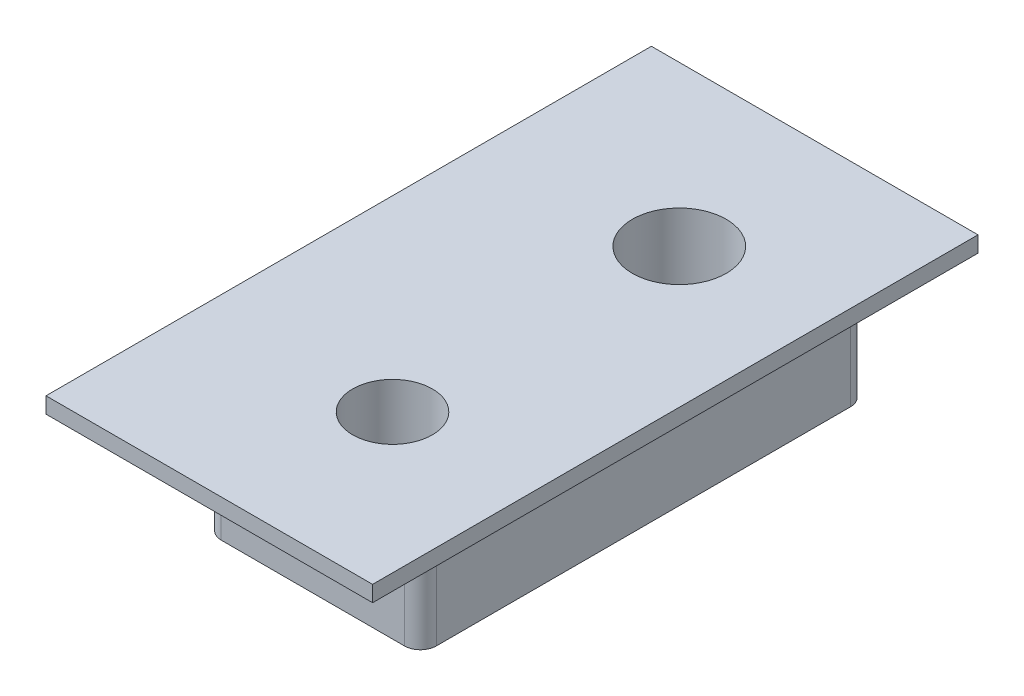
ISO-10303-21;
HEADER;
FILE_DESCRIPTION(('STEP AP214'),'2;1');
FILE_NAME('part.step','',(''),(''),'','','');
FILE_SCHEMA(('AUTOMOTIVE_DESIGN { 1 0 10303 214 1 1 1 1 }'));
ENDSEC;
DATA;
#1=APPLICATION_CONTEXT('core data for automotive mechanical design processes');
#2=APPLICATION_PROTOCOL_DEFINITION('international standard','automotive_design',2000,#1);
#3=PRODUCT_CONTEXT('',#1,'mechanical');
#4=PRODUCT('Part','Part','',(#3));
#5=PRODUCT_RELATED_PRODUCT_CATEGORY('part','',(#4));
#6=PRODUCT_DEFINITION_FORMATION('','',#4);
#7=PRODUCT_DEFINITION_CONTEXT('part definition',#1,'design');
#8=PRODUCT_DEFINITION('design','',#6,#7);
#9=PRODUCT_DEFINITION_SHAPE('','',#8);
#10=(LENGTH_UNIT() NAMED_UNIT(*) SI_UNIT(.MILLI.,.METRE.));
#11=(NAMED_UNIT(*) PLANE_ANGLE_UNIT() SI_UNIT($,.RADIAN.));
#12=(NAMED_UNIT(*) SI_UNIT($,.STERADIAN.) SOLID_ANGLE_UNIT());
#13=UNCERTAINTY_MEASURE_WITH_UNIT(LENGTH_MEASURE(1.E-05),#10,'distance_accuracy_value','');
#14=(GEOMETRIC_REPRESENTATION_CONTEXT(3) GLOBAL_UNCERTAINTY_ASSIGNED_CONTEXT((#13)) GLOBAL_UNIT_ASSIGNED_CONTEXT((#10,
#11,#12)) REPRESENTATION_CONTEXT('',''));
#15=CARTESIAN_POINT('',(0.,0.,0.));
#16=DIRECTION('',(0.,0.,1.));
#17=DIRECTION('',(1.,0.,0.));
#18=AXIS2_PLACEMENT_3D('',#15,#16,#17);
#19=CARTESIAN_POINT('',(5.875,117.675,-9.5));
#20=DIRECTION('',(0.,0.,1.));
#21=DIRECTION('',(1.,0.,0.));
#22=AXIS2_PLACEMENT_3D('',#19,#20,#21);
#23=PLANE('',#22);
#24=DIRECTION('',(0.,1.,0.));
#25=VECTOR('',#24,1.);
#26=CARTESIAN_POINT('',(4.375,117.175,-9.5));
#27=LINE('',#26,#25);
#28=CARTESIAN_POINT('',(4.375,117.175,-9.5));
#29=VERTEX_POINT('',#28);
#30=CARTESIAN_POINT('',(4.375,117.675,-9.5));
#31=VERTEX_POINT('',#30);
#32=EDGE_CURVE('E118',#29,#31,#27,.T.);
#33=ORIENTED_EDGE('',*,*,#32,.F.);
#34=DIRECTION('',(-1.,0.,0.));
#35=VECTOR('',#34,1.);
#36=CARTESIAN_POINT('',(5.875,117.175,-9.5));
#37=LINE('',#36,#35);
#38=CARTESIAN_POINT('',(-5.875,117.175,-9.5));
#39=VERTEX_POINT('',#38);
#40=EDGE_CURVE('E128',#29,#39,#37,.T.);
#41=ORIENTED_EDGE('',*,*,#40,.T.);
#42=DIRECTION('',(0.,-1.,0.));
#43=VECTOR('',#42,1.);
#44=CARTESIAN_POINT('',(-5.875,117.675,-9.5));
#45=LINE('',#44,#43);
#46=CARTESIAN_POINT('',(-5.875,117.675,-9.5));
#47=VERTEX_POINT('',#46);
#48=EDGE_CURVE('E151',#47,#39,#45,.T.);
#49=ORIENTED_EDGE('',*,*,#48,.F.);
#50=DIRECTION('',(-1.,0.,0.));
#51=VECTOR('',#50,1.);
#52=CARTESIAN_POINT('',(5.875,117.675,-9.5));
#53=LINE('',#52,#51);
#54=EDGE_CURVE('E130',#31,#47,#53,.T.);
#55=ORIENTED_EDGE('',*,*,#54,.F.);
#56=EDGE_LOOP('',(#33,#41,#49,#55));
#57=FACE_BOUND('',#56,.T.);
#58=ADVANCED_FACE('F30',(#57),#23,.F.);
#59=CARTESIAN_POINT('',(-5.875,117.675,9.5));
#60=DIRECTION('',(0.,0.,-1.));
#61=DIRECTION('',(-1.,0.,0.));
#62=AXIS2_PLACEMENT_3D('',#59,#60,#61);
#63=PLANE('',#62);
#64=DIRECTION('',(0.,-1.,0.));
#65=VECTOR('',#64,1.);
#66=CARTESIAN_POINT('',(4.375,117.675,9.5));
#67=LINE('',#66,#65);
#68=CARTESIAN_POINT('',(4.375,117.675,9.5));
#69=VERTEX_POINT('',#68);
#70=CARTESIAN_POINT('',(4.375,117.175,9.5));
#71=VERTEX_POINT('',#70);
#72=EDGE_CURVE('E45',#69,#71,#67,.T.);
#73=ORIENTED_EDGE('',*,*,#72,.F.);
#74=DIRECTION('',(1.,0.,0.));
#75=VECTOR('',#74,1.);
#76=CARTESIAN_POINT('',(-5.875,117.675,9.5));
#77=LINE('',#76,#75);
#78=CARTESIAN_POINT('',(-5.875,117.675,9.5));
#79=VERTEX_POINT('',#78);
#80=EDGE_CURVE('E144',#79,#69,#77,.T.);
#81=ORIENTED_EDGE('',*,*,#80,.F.);
#82=DIRECTION('',(0.,-1.,0.));
#83=VECTOR('',#82,1.);
#84=CARTESIAN_POINT('',(-5.875,117.675,9.5));
#85=LINE('',#84,#83);
#86=CARTESIAN_POINT('',(-5.875,117.175,9.5));
#87=VERTEX_POINT('',#86);
#88=EDGE_CURVE('E148',#79,#87,#85,.T.);
#89=ORIENTED_EDGE('',*,*,#88,.T.);
#90=DIRECTION('',(1.,0.,0.));
#91=VECTOR('',#90,1.);
#92=CARTESIAN_POINT('',(-5.875,117.175,9.5));
#93=LINE('',#92,#91);
#94=EDGE_CURVE('E138',#87,#71,#93,.T.);
#95=ORIENTED_EDGE('',*,*,#94,.T.);
#96=EDGE_LOOP('',(#73,#81,#89,#95));
#97=FACE_BOUND('',#96,.T.);
#98=ADVANCED_FACE('F255',(#97),#63,.F.);
#99=CARTESIAN_POINT('',(5.875,117.675,-9.5));
#100=DIRECTION('',(0.,1.,0.));
#101=DIRECTION('',(0.,0.,1.));
#102=AXIS2_PLACEMENT_3D('',#99,#100,#101);
#103=PLANE('',#102);
#104=CARTESIAN_POINT('',(0.,117.675,-4.5));
#105=DIRECTION('',(0.,1.,0.));
#106=DIRECTION('',(0.,0.,1.));
#107=AXIS2_PLACEMENT_3D('',#104,#105,#106);
#108=CIRCLE('',#107,1.47319999999999);
#109=CARTESIAN_POINT('',(0.,117.675,-3.02680000000001));
#110=VERTEX_POINT('',#109);
#111=EDGE_CURVE('E141',#110,#110,#108,.T.);
#112=ORIENTED_EDGE('',*,*,#111,.F.);
#113=EDGE_LOOP('',(#112));
#114=FACE_BOUND('',#113,.T.);
#115=CARTESIAN_POINT('',(0.,117.675,4.5));
#116=DIRECTION('',(0.,1.,0.));
#117=DIRECTION('',(0.,0.,1.));
#118=AXIS2_PLACEMENT_3D('',#115,#116,#117);
#119=CIRCLE('',#118,1.25);
#120=CARTESIAN_POINT('',(0.,117.675,5.75));
#121=VERTEX_POINT('',#120);
#122=EDGE_CURVE('E292',#121,#121,#119,.T.);
#123=ORIENTED_EDGE('',*,*,#122,.F.);
#124=EDGE_LOOP('',(#123));
#125=FACE_BOUND('',#124,.T.);
#126=ORIENTED_EDGE('',*,*,#80,.T.);
#127=DIRECTION('',(0.,0.,1.));
#128=VECTOR('',#127,1.);
#129=CARTESIAN_POINT('',(4.375,117.675,-9.5));
#130=LINE('',#129,#128);
#131=EDGE_CURVE('E131',#31,#69,#130,.T.);
#132=ORIENTED_EDGE('',*,*,#131,.F.);
#133=ORIENTED_EDGE('',*,*,#54,.T.);
#134=DIRECTION('',(0.,0.,1.));
#135=VECTOR('',#134,1.);
#136=CARTESIAN_POINT('',(-5.875,117.675,-9.5));
#137=LINE('',#136,#135);
#138=EDGE_CURVE('E296',#47,#79,#137,.T.);
#139=ORIENTED_EDGE('',*,*,#138,.T.);
#140=EDGE_LOOP('',(#126,#132,#133,#139));
#141=FACE_BOUND('',#140,.T.);
#142=ADVANCED_FACE('F260',(#114,#125,#141),#103,.T.);
#143=CARTESIAN_POINT('',(5.875,117.175,-9.5));
#144=DIRECTION('',(0.,1.,0.));
#145=DIRECTION('',(0.,0.,1.));
#146=AXIS2_PLACEMENT_3D('',#143,#144,#145);
#147=PLANE('',#146);
#148=DIRECTION('',(-1.,0.,0.));
#149=VECTOR('',#148,1.);
#150=CARTESIAN_POINT('',(-3.375,117.175,7.));
#151=LINE('',#150,#149);
#152=CARTESIAN_POINT('',(2.875,117.175,7.));
#153=VERTEX_POINT('',#152);
#154=CARTESIAN_POINT('',(-2.875,117.175,7.));
#155=VERTEX_POINT('',#154);
#156=EDGE_CURVE('E157',#153,#155,#151,.T.);
#157=ORIENTED_EDGE('',*,*,#156,.F.);
#158=CARTESIAN_POINT('',(2.875,117.175,6.5));
#159=DIRECTION('',(0.,1.,0.));
#160=DIRECTION('',(0.,0.,1.));
#161=AXIS2_PLACEMENT_3D('',#158,#159,#160);
#162=CIRCLE('',#161,0.5);
#163=CARTESIAN_POINT('',(3.375,117.175,6.5));
#164=VERTEX_POINT('',#163);
#165=EDGE_CURVE('E11',#153,#164,#162,.T.);
#166=ORIENTED_EDGE('',*,*,#165,.T.);
#167=DIRECTION('',(0.,0.,-1.));
#168=VECTOR('',#167,1.);
#169=CARTESIAN_POINT('',(3.375,117.175,7.));
#170=LINE('',#169,#168);
#171=CARTESIAN_POINT('',(3.375,117.175,-6.5));
#172=VERTEX_POINT('',#171);
#173=EDGE_CURVE('E171',#164,#172,#170,.T.);
#174=ORIENTED_EDGE('',*,*,#173,.T.);
#175=CARTESIAN_POINT('',(2.875,117.175,-6.5));
#176=DIRECTION('',(0.,1.,0.));
#177=DIRECTION('',(0.,0.,1.));
#178=AXIS2_PLACEMENT_3D('',#175,#176,#177);
#179=CIRCLE('',#178,0.5);
#180=CARTESIAN_POINT('',(2.875,117.175,-7.));
#181=VERTEX_POINT('',#180);
#182=EDGE_CURVE('E38',#172,#181,#179,.T.);
#183=ORIENTED_EDGE('',*,*,#182,.T.);
#184=DIRECTION('',(-1.,0.,0.));
#185=VECTOR('',#184,1.);
#186=CARTESIAN_POINT('',(-3.375,117.175,-7.));
#187=LINE('',#186,#185);
#188=CARTESIAN_POINT('',(-2.875,117.175,-7.));
#189=VERTEX_POINT('',#188);
#190=EDGE_CURVE('E158',#181,#189,#187,.T.);
#191=ORIENTED_EDGE('',*,*,#190,.T.);
#192=CARTESIAN_POINT('',(-2.875,117.175,-6.5));
#193=DIRECTION('',(0.,1.,0.));
#194=DIRECTION('',(0.,0.,1.));
#195=AXIS2_PLACEMENT_3D('',#192,#193,#194);
#196=CIRCLE('',#195,0.5);
#197=CARTESIAN_POINT('',(-3.375,117.175,-6.5));
#198=VERTEX_POINT('',#197);
#199=EDGE_CURVE('E204',#189,#198,#196,.T.);
#200=ORIENTED_EDGE('',*,*,#199,.T.);
#201=DIRECTION('',(0.,0.,-1.));
#202=VECTOR('',#201,1.);
#203=CARTESIAN_POINT('',(-3.375,117.175,7.));
#204=LINE('',#203,#202);
#205=CARTESIAN_POINT('',(-3.375,117.175,6.5));
#206=VERTEX_POINT('',#205);
#207=EDGE_CURVE('E168',#206,#198,#204,.T.);
#208=ORIENTED_EDGE('',*,*,#207,.F.);
#209=CARTESIAN_POINT('',(-2.875,117.175,6.5));
#210=DIRECTION('',(0.,1.,0.));
#211=DIRECTION('',(0.,0.,1.));
#212=AXIS2_PLACEMENT_3D('',#209,#210,#211);
#213=CIRCLE('',#212,0.5);
#214=EDGE_CURVE('E206',#206,#155,#213,.T.);
#215=ORIENTED_EDGE('',*,*,#214,.T.);
#216=EDGE_LOOP('',(#157,#166,#174,#183,#191,#200,#208,#215));
#217=FACE_BOUND('',#216,.T.);
#218=DIRECTION('',(0.,0.,-1.));
#219=VECTOR('',#218,1.);
#220=CARTESIAN_POINT('',(4.375,117.175,9.5));
#221=LINE('',#220,#219);
#222=EDGE_CURVE('E115',#71,#29,#221,.T.);
#223=ORIENTED_EDGE('',*,*,#222,.F.);
#224=ORIENTED_EDGE('',*,*,#94,.F.);
#225=DIRECTION('',(0.,0.,1.));
#226=VECTOR('',#225,1.);
#227=CARTESIAN_POINT('',(-5.875,117.175,-9.5));
#228=LINE('',#227,#226);
#229=EDGE_CURVE('E135',#39,#87,#228,.T.);
#230=ORIENTED_EDGE('',*,*,#229,.F.);
#231=ORIENTED_EDGE('',*,*,#40,.F.);
#232=EDGE_LOOP('',(#223,#224,#230,#231));
#233=FACE_BOUND('',#232,.T.);
#234=ADVANCED_FACE('F134',(#217,#233),#147,.F.);
#235=CARTESIAN_POINT('',(3.375,114.,7.));
#236=DIRECTION('',(0.,1.,0.));
#237=DIRECTION('',(0.,0.,1.));
#238=AXIS2_PLACEMENT_3D('',#235,#236,#237);
#239=PLANE('',#238);
#240=CARTESIAN_POINT('',(0.,114.,4.5));
#241=DIRECTION('',(0.,1.,0.));
#242=DIRECTION('',(0.,0.,1.));
#243=AXIS2_PLACEMENT_3D('',#240,#241,#242);
#244=CIRCLE('',#243,1.25);
#245=CARTESIAN_POINT('',(0.,114.,5.75));
#246=VERTEX_POINT('',#245);
#247=EDGE_CURVE('E282',#246,#246,#244,.T.);
#248=ORIENTED_EDGE('',*,*,#247,.T.);
#249=EDGE_LOOP('',(#248));
#250=FACE_BOUND('',#249,.T.);
#251=CARTESIAN_POINT('',(0.,114.,-4.5));
#252=DIRECTION('',(0.,1.,0.));
#253=DIRECTION('',(0.,0.,1.));
#254=AXIS2_PLACEMENT_3D('',#251,#252,#253);
#255=CIRCLE('',#254,1.4732);
#256=CARTESIAN_POINT('',(0.,114.,-3.0268));
#257=VERTEX_POINT('',#256);
#258=EDGE_CURVE('E136',#257,#257,#255,.T.);
#259=ORIENTED_EDGE('',*,*,#258,.T.);
#260=EDGE_LOOP('',(#259));
#261=FACE_BOUND('',#260,.T.);
#262=DIRECTION('',(0.,0.,-1.));
#263=VECTOR('',#262,1.);
#264=CARTESIAN_POINT('',(-3.375,114.,7.));
#265=LINE('',#264,#263);
#266=CARTESIAN_POINT('',(-3.375,114.,6.5));
#267=VERTEX_POINT('',#266);
#268=CARTESIAN_POINT('',(-3.375,114.,-6.5));
#269=VERTEX_POINT('',#268);
#270=EDGE_CURVE('E161',#267,#269,#265,.T.);
#271=ORIENTED_EDGE('',*,*,#270,.T.);
#272=CARTESIAN_POINT('',(-2.875,114.,-6.5));
#273=DIRECTION('',(0.,1.,0.));
#274=DIRECTION('',(0.,0.,1.));
#275=AXIS2_PLACEMENT_3D('',#272,#273,#274);
#276=CIRCLE('',#275,0.5);
#277=CARTESIAN_POINT('',(-2.875,114.,-7.));
#278=VERTEX_POINT('',#277);
#279=EDGE_CURVE('E188',#269,#278,#276,.F.);
#280=ORIENTED_EDGE('',*,*,#279,.T.);
#281=DIRECTION('',(1.,0.,0.));
#282=VECTOR('',#281,1.);
#283=CARTESIAN_POINT('',(3.375,114.,-7.));
#284=LINE('',#283,#282);
#285=CARTESIAN_POINT('',(2.875,114.,-7.));
#286=VERTEX_POINT('',#285);
#287=EDGE_CURVE('E153',#278,#286,#284,.T.);
#288=ORIENTED_EDGE('',*,*,#287,.T.);
#289=CARTESIAN_POINT('',(2.875,114.,-6.5));
#290=DIRECTION('',(0.,1.,0.));
#291=DIRECTION('',(0.,0.,1.));
#292=AXIS2_PLACEMENT_3D('',#289,#290,#291);
#293=CIRCLE('',#292,0.5);
#294=CARTESIAN_POINT('',(3.375,114.,-6.5));
#295=VERTEX_POINT('',#294);
#296=EDGE_CURVE('E184',#286,#295,#293,.F.);
#297=ORIENTED_EDGE('',*,*,#296,.T.);
#298=DIRECTION('',(0.,0.,-1.));
#299=VECTOR('',#298,1.);
#300=CARTESIAN_POINT('',(3.375,114.,7.));
#301=LINE('',#300,#299);
#302=CARTESIAN_POINT('',(3.375,114.,6.5));
#303=VERTEX_POINT('',#302);
#304=EDGE_CURVE('E174',#303,#295,#301,.T.);
#305=ORIENTED_EDGE('',*,*,#304,.F.);
#306=CARTESIAN_POINT('',(2.875,114.,6.5));
#307=DIRECTION('',(0.,1.,0.));
#308=DIRECTION('',(0.,0.,1.));
#309=AXIS2_PLACEMENT_3D('',#306,#307,#308);
#310=CIRCLE('',#309,0.5);
#311=CARTESIAN_POINT('',(2.875,114.,7.));
#312=VERTEX_POINT('',#311);
#313=EDGE_CURVE('E182',#303,#312,#310,.F.);
#314=ORIENTED_EDGE('',*,*,#313,.T.);
#315=DIRECTION('',(1.,0.,0.));
#316=VECTOR('',#315,1.);
#317=CARTESIAN_POINT('',(3.375,114.,7.));
#318=LINE('',#317,#316);
#319=CARTESIAN_POINT('',(-2.875,114.,7.));
#320=VERTEX_POINT('',#319);
#321=EDGE_CURVE('E154',#320,#312,#318,.T.);
#322=ORIENTED_EDGE('',*,*,#321,.F.);
#323=CARTESIAN_POINT('',(-2.875,114.,6.5));
#324=DIRECTION('',(0.,1.,0.));
#325=DIRECTION('',(0.,0.,1.));
#326=AXIS2_PLACEMENT_3D('',#323,#324,#325);
#327=CIRCLE('',#326,0.5);
#328=EDGE_CURVE('E186',#320,#267,#327,.F.);
#329=ORIENTED_EDGE('',*,*,#328,.T.);
#330=EDGE_LOOP('',(#271,#280,#288,#297,#305,#314,#322,#329));
#331=FACE_BOUND('',#330,.T.);
#332=ADVANCED_FACE('F220',(#250,#261,#331),#239,.F.);
#333=CARTESIAN_POINT('',(3.375,117.175,7.));
#334=DIRECTION('',(-1.,0.,0.));
#335=DIRECTION('',(0.,0.,1.));
#336=AXIS2_PLACEMENT_3D('',#333,#334,#335);
#337=PLANE('',#336);
#338=ORIENTED_EDGE('',*,*,#304,.T.);
#339=DIRECTION('',(0.,1.,0.));
#340=VECTOR('',#339,1.);
#341=CARTESIAN_POINT('',(3.375,117.175,-6.5));
#342=LINE('',#341,#340);
#343=EDGE_CURVE('E202',#295,#172,#342,.T.);
#344=ORIENTED_EDGE('',*,*,#343,.T.);
#345=ORIENTED_EDGE('',*,*,#173,.F.);
#346=DIRECTION('',(0.,1.,0.));
#347=VECTOR('',#346,1.);
#348=CARTESIAN_POINT('',(3.375,114.,6.5));
#349=LINE('',#348,#347);
#350=EDGE_CURVE('E200',#164,#303,#349,.F.);
#351=ORIENTED_EDGE('',*,*,#350,.T.);
#352=EDGE_LOOP('',(#338,#344,#345,#351));
#353=FACE_BOUND('',#352,.T.);
#354=ADVANCED_FACE('F223',(#353),#337,.F.);
#355=CARTESIAN_POINT('',(-3.375,114.,7.));
#356=DIRECTION('',(1.,0.,0.));
#357=DIRECTION('',(0.,1.,0.));
#358=AXIS2_PLACEMENT_3D('',#355,#356,#357);
#359=PLANE('',#358);
#360=ORIENTED_EDGE('',*,*,#207,.T.);
#361=DIRECTION('',(0.,-1.,0.));
#362=VECTOR('',#361,1.);
#363=CARTESIAN_POINT('',(-3.375,114.,-6.5));
#364=LINE('',#363,#362);
#365=EDGE_CURVE('E179',#198,#269,#364,.T.);
#366=ORIENTED_EDGE('',*,*,#365,.T.);
#367=ORIENTED_EDGE('',*,*,#270,.F.);
#368=DIRECTION('',(0.,-1.,0.));
#369=VECTOR('',#368,1.);
#370=CARTESIAN_POINT('',(-3.375,117.175,6.5));
#371=LINE('',#370,#369);
#372=EDGE_CURVE('E177',#267,#206,#371,.F.);
#373=ORIENTED_EDGE('',*,*,#372,.T.);
#374=EDGE_LOOP('',(#360,#366,#367,#373));
#375=FACE_BOUND('',#374,.T.);
#376=ADVANCED_FACE('F237',(#375),#359,.F.);
#377=CARTESIAN_POINT('',(3.375,114.,7.));
#378=DIRECTION('',(0.,0.,1.));
#379=DIRECTION('',(1.,0.,0.));
#380=AXIS2_PLACEMENT_3D('',#377,#378,#379);
#381=PLANE('',#380);
#382=ORIENTED_EDGE('',*,*,#156,.T.);
#383=DIRECTION('',(0.,-1.,0.));
#384=VECTOR('',#383,1.);
#385=CARTESIAN_POINT('',(-2.875,114.,7.));
#386=LINE('',#385,#384);
#387=EDGE_CURVE('E197',#155,#320,#386,.T.);
#388=ORIENTED_EDGE('',*,*,#387,.T.);
#389=ORIENTED_EDGE('',*,*,#321,.T.);
#390=DIRECTION('',(0.,1.,0.));
#391=VECTOR('',#390,1.);
#392=CARTESIAN_POINT('',(2.875,117.175,7.));
#393=LINE('',#392,#391);
#394=EDGE_CURVE('E194',#312,#153,#393,.T.);
#395=ORIENTED_EDGE('',*,*,#394,.T.);
#396=EDGE_LOOP('',(#382,#388,#389,#395));
#397=FACE_BOUND('',#396,.T.);
#398=ADVANCED_FACE('F229',(#397),#381,.T.);
#399=CARTESIAN_POINT('',(3.375,114.,-7.));
#400=DIRECTION('',(0.,0.,1.));
#401=DIRECTION('',(1.,0.,0.));
#402=AXIS2_PLACEMENT_3D('',#399,#400,#401);
#403=PLANE('',#402);
#404=ORIENTED_EDGE('',*,*,#287,.F.);
#405=DIRECTION('',(0.,-1.,0.));
#406=VECTOR('',#405,1.);
#407=CARTESIAN_POINT('',(-2.875,114.,-7.));
#408=LINE('',#407,#406);
#409=EDGE_CURVE('E192',#278,#189,#408,.F.);
#410=ORIENTED_EDGE('',*,*,#409,.T.);
#411=ORIENTED_EDGE('',*,*,#190,.F.);
#412=DIRECTION('',(0.,1.,0.));
#413=VECTOR('',#412,1.);
#414=CARTESIAN_POINT('',(2.875,114.,-7.));
#415=LINE('',#414,#413);
#416=EDGE_CURVE('E190',#181,#286,#415,.F.);
#417=ORIENTED_EDGE('',*,*,#416,.T.);
#418=EDGE_LOOP('',(#404,#410,#411,#417));
#419=FACE_BOUND('',#418,.T.);
#420=ADVANCED_FACE('F214',(#419),#403,.F.);
#421=CARTESIAN_POINT('',(-5.875,117.675,-9.5));
#422=DIRECTION('',(1.,0.,0.));
#423=DIRECTION('',(0.,0.,-1.));
#424=AXIS2_PLACEMENT_3D('',#421,#422,#423);
#425=PLANE('',#424);
#426=ORIENTED_EDGE('',*,*,#229,.T.);
#427=ORIENTED_EDGE('',*,*,#88,.F.);
#428=ORIENTED_EDGE('',*,*,#138,.F.);
#429=ORIENTED_EDGE('',*,*,#48,.T.);
#430=EDGE_LOOP('',(#426,#427,#428,#429));
#431=FACE_BOUND('',#430,.T.);
#432=ADVANCED_FACE('F265',(#431),#425,.F.);
#433=CARTESIAN_POINT('',(0.,117.675,-4.5));
#434=DIRECTION('',(0.,1.,0.));
#435=DIRECTION('',(0.,0.,1.));
#436=AXIS2_PLACEMENT_3D('',#433,#434,#435);
#437=CYLINDRICAL_SURFACE('',#436,1.47319999999999);
#438=ORIENTED_EDGE('',*,*,#258,.F.);
#439=EDGE_LOOP('',(#438));
#440=FACE_BOUND('',#439,.T.);
#441=ORIENTED_EDGE('',*,*,#111,.T.);
#442=EDGE_LOOP('',(#441));
#443=FACE_BOUND('',#442,.T.);
#444=ADVANCED_FACE('F250',(#440,#443),#437,.F.);
#445=CARTESIAN_POINT('',(0.,114.,4.5));
#446=DIRECTION('',(0.,1.,0.));
#447=DIRECTION('',(0.,0.,1.));
#448=AXIS2_PLACEMENT_3D('',#445,#446,#447);
#449=CYLINDRICAL_SURFACE('',#448,1.25);
#450=ORIENTED_EDGE('',*,*,#247,.F.);
#451=EDGE_LOOP('',(#450));
#452=FACE_BOUND('',#451,.T.);
#453=ORIENTED_EDGE('',*,*,#122,.T.);
#454=EDGE_LOOP('',(#453));
#455=FACE_BOUND('',#454,.T.);
#456=ADVANCED_FACE('F243',(#452,#455),#449,.F.);
#457=CARTESIAN_POINT('',(-2.875,114.,-6.5));
#458=DIRECTION('',(0.,-1.,0.));
#459=DIRECTION('',(1.,0.,0.));
#460=AXIS2_PLACEMENT_3D('',#457,#458,#459);
#461=CYLINDRICAL_SURFACE('',#460,0.5);
#462=ORIENTED_EDGE('',*,*,#199,.F.);
#463=ORIENTED_EDGE('',*,*,#409,.F.);
#464=ORIENTED_EDGE('',*,*,#279,.F.);
#465=ORIENTED_EDGE('',*,*,#365,.F.);
#466=EDGE_LOOP('',(#462,#463,#464,#465));
#467=FACE_BOUND('',#466,.T.);
#468=ADVANCED_FACE('F241',(#467),#461,.T.);
#469=CARTESIAN_POINT('',(-2.875,114.,6.5));
#470=DIRECTION('',(0.,1.,0.));
#471=DIRECTION('',(-1.,0.,0.));
#472=AXIS2_PLACEMENT_3D('',#469,#470,#471);
#473=CYLINDRICAL_SURFACE('',#472,0.5);
#474=ORIENTED_EDGE('',*,*,#214,.F.);
#475=ORIENTED_EDGE('',*,*,#372,.F.);
#476=ORIENTED_EDGE('',*,*,#328,.F.);
#477=ORIENTED_EDGE('',*,*,#387,.F.);
#478=EDGE_LOOP('',(#474,#475,#476,#477));
#479=FACE_BOUND('',#478,.T.);
#480=ADVANCED_FACE('F233',(#479),#473,.T.);
#481=CARTESIAN_POINT('',(2.875,117.175,-6.5));
#482=DIRECTION('',(0.,1.,0.));
#483=DIRECTION('',(0.,0.,1.));
#484=AXIS2_PLACEMENT_3D('',#481,#482,#483);
#485=CYLINDRICAL_SURFACE('',#484,0.5);
#486=ORIENTED_EDGE('',*,*,#296,.F.);
#487=ORIENTED_EDGE('',*,*,#416,.F.);
#488=ORIENTED_EDGE('',*,*,#182,.F.);
#489=ORIENTED_EDGE('',*,*,#343,.F.);
#490=EDGE_LOOP('',(#486,#487,#488,#489));
#491=FACE_BOUND('',#490,.T.);
#492=ADVANCED_FACE('F217',(#491),#485,.T.);
#493=CARTESIAN_POINT('',(2.875,114.,6.5));
#494=DIRECTION('',(0.,-1.,0.));
#495=DIRECTION('',(0.,0.,-1.));
#496=AXIS2_PLACEMENT_3D('',#493,#494,#495);
#497=CYLINDRICAL_SURFACE('',#496,0.5);
#498=ORIENTED_EDGE('',*,*,#313,.F.);
#499=ORIENTED_EDGE('',*,*,#350,.F.);
#500=ORIENTED_EDGE('',*,*,#165,.F.);
#501=ORIENTED_EDGE('',*,*,#394,.F.);
#502=EDGE_LOOP('',(#498,#499,#500,#501));
#503=FACE_BOUND('',#502,.T.);
#504=ADVANCED_FACE('F32',(#503),#497,.T.);
#505=CARTESIAN_POINT('',(4.375,117.175,9.5));
#506=DIRECTION('',(1.,0.,0.));
#507=DIRECTION('',(0.,0.,-1.));
#508=AXIS2_PLACEMENT_3D('',#505,#506,#507);
#509=PLANE('',#508);
#510=ORIENTED_EDGE('',*,*,#72,.T.);
#511=ORIENTED_EDGE('',*,*,#222,.T.);
#512=ORIENTED_EDGE('',*,*,#32,.T.);
#513=ORIENTED_EDGE('',*,*,#131,.T.);
#514=EDGE_LOOP('',(#510,#511,#512,#513));
#515=FACE_BOUND('',#514,.T.);
#516=ADVANCED_FACE('F117',(#515),#509,.T.);
#517=CLOSED_SHELL('',(#58,#98,#142,#234,#332,#354,#376,#398,#420,#432,#444,#456,#468,#480,#492,
#504,#516));
#518=MANIFOLD_SOLID_BREP('B2',#517);
#519=ADVANCED_BREP_SHAPE_REPRESENTATION('',(#18,#518),#14);
#520=SHAPE_DEFINITION_REPRESENTATION(#9,#519);
ENDSEC;
END-ISO-10303-21;
